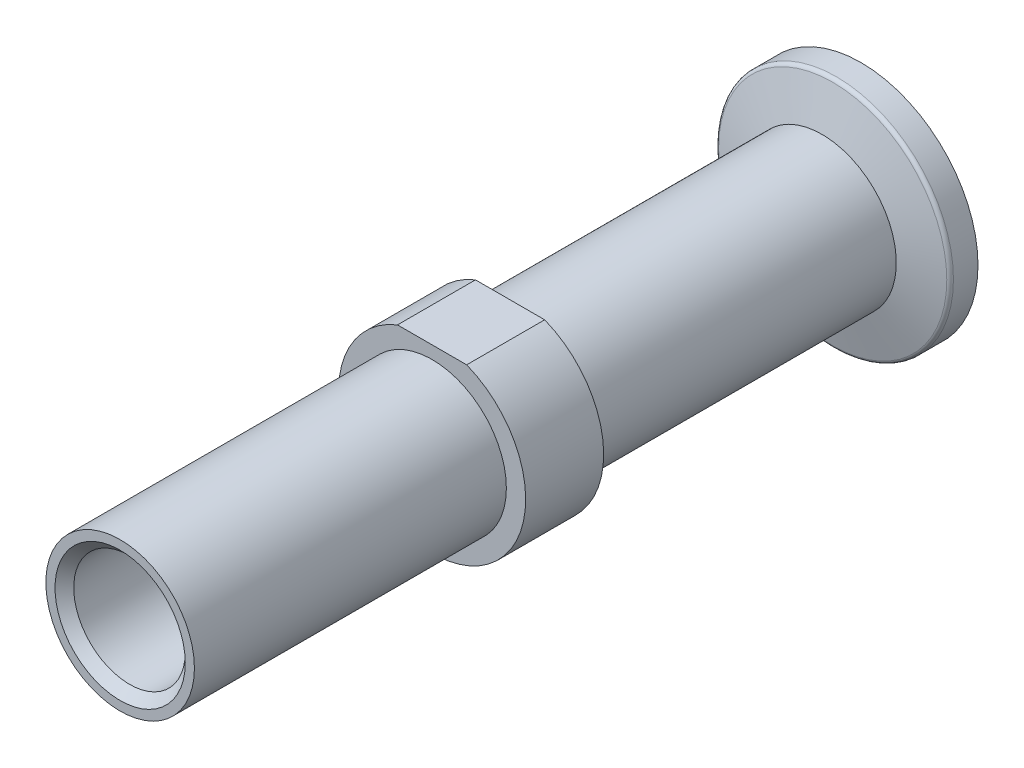
ISO-10303-21;
HEADER;
FILE_DESCRIPTION(('STEP AP214'),'2;1');
FILE_NAME('part.step','',(''),(''),'','','');
FILE_SCHEMA(('AUTOMOTIVE_DESIGN { 1 0 10303 214 1 1 1 1 }'));
ENDSEC;
DATA;
#1=APPLICATION_CONTEXT('core data for automotive mechanical design processes');
#2=APPLICATION_PROTOCOL_DEFINITION('international standard','automotive_design',2000,#1);
#3=PRODUCT_CONTEXT('',#1,'mechanical');
#4=PRODUCT('Part','Part','',(#3));
#5=PRODUCT_RELATED_PRODUCT_CATEGORY('part','',(#4));
#6=PRODUCT_DEFINITION_FORMATION('','',#4);
#7=PRODUCT_DEFINITION_CONTEXT('part definition',#1,'design');
#8=PRODUCT_DEFINITION('design','',#6,#7);
#9=PRODUCT_DEFINITION_SHAPE('','',#8);
#10=(LENGTH_UNIT() NAMED_UNIT(*) SI_UNIT(.MILLI.,.METRE.));
#11=(NAMED_UNIT(*) PLANE_ANGLE_UNIT() SI_UNIT($,.RADIAN.));
#12=(NAMED_UNIT(*) SI_UNIT($,.STERADIAN.) SOLID_ANGLE_UNIT());
#13=UNCERTAINTY_MEASURE_WITH_UNIT(LENGTH_MEASURE(1.E-05),#10,'distance_accuracy_value','');
#14=(GEOMETRIC_REPRESENTATION_CONTEXT(3) GLOBAL_UNCERTAINTY_ASSIGNED_CONTEXT((#13)) GLOBAL_UNIT_ASSIGNED_CONTEXT((#10,
#11,#12)) REPRESENTATION_CONTEXT('',''));
#15=CARTESIAN_POINT('',(0.,0.,0.));
#16=DIRECTION('',(0.,0.,1.));
#17=DIRECTION('',(1.,0.,0.));
#18=AXIS2_PLACEMENT_3D('',#15,#16,#17);
#19=CARTESIAN_POINT('',(0.,0.,90.));
#20=DIRECTION('',(0.,0.,-1.));
#21=DIRECTION('',(-1.,0.,0.));
#22=AXIS2_PLACEMENT_3D('',#19,#20,#21);
#23=CYLINDRICAL_SURFACE('',#22,12.);
#24=CARTESIAN_POINT('',(0.,0.,40.));
#25=DIRECTION('',(0.,0.,-1.));
#26=DIRECTION('',(-1.,0.,0.));
#27=AXIS2_PLACEMENT_3D('',#24,#25,#26);
#28=CIRCLE('',#27,12.);
#29=CARTESIAN_POINT('',(4.43593282185383,11.15,40.));
#30=VERTEX_POINT('',#29);
#31=CARTESIAN_POINT('',(-4.43593282185383,11.15,40.));
#32=VERTEX_POINT('',#31);
#33=EDGE_CURVE('E96',#30,#32,#28,.T.);
#34=ORIENTED_EDGE('',*,*,#33,.F.);
#35=DIRECTION('',(0.,0.,-1.));
#36=VECTOR('',#35,1.);
#37=CARTESIAN_POINT('',(4.43593282185383,11.15,90.));
#38=LINE('',#37,#36);
#39=CARTESIAN_POINT('',(4.43593282185383,11.15,50.));
#40=VERTEX_POINT('',#39);
#41=EDGE_CURVE('E61',#40,#30,#38,.T.);
#42=ORIENTED_EDGE('',*,*,#41,.F.);
#43=CARTESIAN_POINT('',(0.,0.,50.));
#44=DIRECTION('',(0.,0.,1.));
#45=DIRECTION('',(1.,0.,0.));
#46=AXIS2_PLACEMENT_3D('',#43,#44,#45);
#47=CIRCLE('',#46,12.);
#48=CARTESIAN_POINT('',(-4.43593282185383,11.15,50.));
#49=VERTEX_POINT('',#48);
#50=EDGE_CURVE('E83',#49,#40,#47,.T.);
#51=ORIENTED_EDGE('',*,*,#50,.F.);
#52=DIRECTION('',(0.,0.,-1.));
#53=VECTOR('',#52,1.);
#54=CARTESIAN_POINT('',(-4.43593282185383,11.15,90.));
#55=LINE('',#54,#53);
#56=EDGE_CURVE('E71',#49,#32,#55,.T.);
#57=ORIENTED_EDGE('',*,*,#56,.T.);
#58=EDGE_LOOP('',(#34,#42,#51,#57));
#59=FACE_BOUND('',#58,.T.);
#60=ADVANCED_FACE('F47',(#59),#23,.T.);
#61=CARTESIAN_POINT('',(0.,0.,50.));
#62=DIRECTION('',(0.,0.,1.));
#63=DIRECTION('',(1.,0.,0.));
#64=AXIS2_PLACEMENT_3D('',#61,#62,#63);
#65=PLANE('',#64);
#66=DIRECTION('',(1.,0.,0.));
#67=VECTOR('',#66,1.);
#68=CARTESIAN_POINT('',(0.,11.15,50.));
#69=LINE('',#68,#67);
#70=EDGE_CURVE('E66',#49,#40,#69,.T.);
#71=ORIENTED_EDGE('',*,*,#70,.F.);
#72=ORIENTED_EDGE('',*,*,#50,.T.);
#73=EDGE_LOOP('',(#71,#72));
#74=FACE_BOUND('',#73,.T.);
#75=CARTESIAN_POINT('',(0.,0.,50.));
#76=DIRECTION('',(0.,0.,1.));
#77=DIRECTION('',(1.,0.,0.));
#78=AXIS2_PLACEMENT_3D('',#75,#76,#77);
#79=CIRCLE('',#78,9.525);
#80=CARTESIAN_POINT('',(9.525,0.,50.));
#81=VERTEX_POINT('',#80);
#82=EDGE_CURVE('E87',#81,#81,#79,.T.);
#83=ORIENTED_EDGE('',*,*,#82,.F.);
#84=EDGE_LOOP('',(#83));
#85=FACE_BOUND('',#84,.T.);
#86=ADVANCED_FACE('F81',(#74,#85),#65,.T.);
#87=CARTESIAN_POINT('',(0.,0.,50.));
#88=DIRECTION('',(0.,0.,1.));
#89=DIRECTION('',(1.,0.,0.));
#90=AXIS2_PLACEMENT_3D('',#87,#88,#89);
#91=CYLINDRICAL_SURFACE('',#90,9.525);
#92=ORIENTED_EDGE('',*,*,#82,.T.);
#93=EDGE_LOOP('',(#92));
#94=FACE_BOUND('',#93,.T.);
#95=CARTESIAN_POINT('',(0.,0.,90.));
#96=DIRECTION('',(0.,0.,1.));
#97=DIRECTION('',(1.,0.,0.));
#98=AXIS2_PLACEMENT_3D('',#95,#96,#97);
#99=CIRCLE('',#98,9.525);
#100=CARTESIAN_POINT('',(9.525,0.,90.));
#101=VERTEX_POINT('',#100);
#102=EDGE_CURVE('E92',#101,#101,#99,.T.);
#103=ORIENTED_EDGE('',*,*,#102,.F.);
#104=EDGE_LOOP('',(#103));
#105=FACE_BOUND('',#104,.T.);
#106=ADVANCED_FACE('F154',(#94,#105),#91,.T.);
#107=CARTESIAN_POINT('',(0.,0.,90.));
#108=DIRECTION('',(0.,0.,1.));
#109=DIRECTION('',(1.,0.,0.));
#110=AXIS2_PLACEMENT_3D('',#107,#108,#109);
#111=PLANE('',#110);
#112=CARTESIAN_POINT('',(0.,0.,90.));
#113=DIRECTION('',(0.,0.,1.));
#114=DIRECTION('',(1.,0.,0.));
#115=AXIS2_PLACEMENT_3D('',#112,#113,#114);
#116=CIRCLE('',#115,8.35000000000008);
#117=CARTESIAN_POINT('',(8.35000000000008,0.,90.));
#118=VERTEX_POINT('',#117);
#119=EDGE_CURVE('E55',#118,#118,#116,.F.);
#120=ORIENTED_EDGE('',*,*,#119,.T.);
#121=EDGE_LOOP('',(#120));
#122=FACE_BOUND('',#121,.T.);
#123=ORIENTED_EDGE('',*,*,#102,.T.);
#124=EDGE_LOOP('',(#123));
#125=FACE_BOUND('',#124,.T.);
#126=ADVANCED_FACE('F101',(#122,#125),#111,.T.);
#127=CARTESIAN_POINT('',(0.,0.,40.));
#128=DIRECTION('',(0.,0.,-1.));
#129=DIRECTION('',(-1.,0.,0.));
#130=AXIS2_PLACEMENT_3D('',#127,#128,#129);
#131=PLANE('',#130);
#132=DIRECTION('',(-1.,0.,0.));
#133=VECTOR('',#132,1.);
#134=CARTESIAN_POINT('',(0.,11.15,40.));
#135=LINE('',#134,#133);
#136=EDGE_CURVE('E14',#30,#32,#135,.T.);
#137=ORIENTED_EDGE('',*,*,#136,.F.);
#138=ORIENTED_EDGE('',*,*,#33,.T.);
#139=EDGE_LOOP('',(#137,#138));
#140=FACE_BOUND('',#139,.T.);
#141=CARTESIAN_POINT('',(0.,0.,40.));
#142=DIRECTION('',(0.,0.,-1.));
#143=DIRECTION('',(-1.,0.,0.));
#144=AXIS2_PLACEMENT_3D('',#141,#142,#143);
#145=CIRCLE('',#144,9.525);
#146=CARTESIAN_POINT('',(-9.525,0.,40.));
#147=VERTEX_POINT('',#146);
#148=EDGE_CURVE('E97',#147,#147,#145,.T.);
#149=ORIENTED_EDGE('',*,*,#148,.F.);
#150=EDGE_LOOP('',(#149));
#151=FACE_BOUND('',#150,.T.);
#152=ADVANCED_FACE('F142',(#140,#151),#131,.T.);
#153=CARTESIAN_POINT('',(0.,0.,40.));
#154=DIRECTION('',(0.,0.,-1.));
#155=DIRECTION('',(-1.,0.,0.));
#156=AXIS2_PLACEMENT_3D('',#153,#154,#155);
#157=CYLINDRICAL_SURFACE('',#156,9.525);
#158=ORIENTED_EDGE('',*,*,#148,.T.);
#159=EDGE_LOOP('',(#158));
#160=FACE_BOUND('',#159,.T.);
#161=CARTESIAN_POINT('',(0.,0.,0.));
#162=DIRECTION('',(0.,0.,-1.));
#163=DIRECTION('',(-1.,0.,0.));
#164=AXIS2_PLACEMENT_3D('',#161,#162,#163);
#165=CIRCLE('',#164,9.525);
#166=CARTESIAN_POINT('',(-9.525,0.,0.));
#167=VERTEX_POINT('',#166);
#168=EDGE_CURVE('E84',#167,#167,#165,.T.);
#169=ORIENTED_EDGE('',*,*,#168,.F.);
#170=EDGE_LOOP('',(#169));
#171=FACE_BOUND('',#170,.T.);
#172=ADVANCED_FACE('F111',(#160,#171),#157,.T.);
#173=CARTESIAN_POINT('',(0.,0.,0.));
#174=DIRECTION('',(0.,0.,1.));
#175=DIRECTION('',(1.,0.,0.));
#176=AXIS2_PLACEMENT_3D('',#173,#174,#175);
#177=CYLINDRICAL_SURFACE('',#176,7.15);
#178=CARTESIAN_POINT('',(0.,0.,88.7999999999999));
#179=DIRECTION('',(0.,0.,1.));
#180=DIRECTION('',(1.,0.,0.));
#181=AXIS2_PLACEMENT_3D('',#178,#179,#180);
#182=CIRCLE('',#181,7.15);
#183=CARTESIAN_POINT('',(7.15,0.,88.7999999999999));
#184=VERTEX_POINT('',#183);
#185=EDGE_CURVE('E86',#184,#184,#182,.T.);
#186=ORIENTED_EDGE('',*,*,#185,.T.);
#187=EDGE_LOOP('',(#186));
#188=FACE_BOUND('',#187,.T.);
#189=CARTESIAN_POINT('',(0.,0.,-2.5));
#190=DIRECTION('',(0.,0.,1.));
#191=DIRECTION('',(1.,0.,0.));
#192=AXIS2_PLACEMENT_3D('',#189,#190,#191);
#193=CIRCLE('',#192,7.15);
#194=CARTESIAN_POINT('',(7.15,0.,-2.5));
#195=VERTEX_POINT('',#194);
#196=EDGE_CURVE('E115',#195,#195,#193,.T.);
#197=ORIENTED_EDGE('',*,*,#196,.F.);
#198=EDGE_LOOP('',(#197));
#199=FACE_BOUND('',#198,.T.);
#200=ADVANCED_FACE('F106',(#188,#199),#177,.F.);
#201=CARTESIAN_POINT('',(0.,0.,88.7999999999999));
#202=DIRECTION('',(0.,0.,1.));
#203=DIRECTION('',(1.,0.,0.));
#204=AXIS2_PLACEMENT_3D('',#201,#202,#203);
#205=CONICAL_SURFACE('',#204,7.15,0.785398163397444);
#206=ORIENTED_EDGE('',*,*,#119,.F.);
#207=EDGE_LOOP('',(#206));
#208=FACE_BOUND('',#207,.T.);
#209=ORIENTED_EDGE('',*,*,#185,.F.);
#210=EDGE_LOOP('',(#209));
#211=FACE_BOUND('',#210,.T.);
#212=ADVANCED_FACE('F49',(#208,#211),#205,.F.);
#213=CARTESIAN_POINT('',(0.,11.15,90.));
#214=DIRECTION('',(0.,-1.,0.));
#215=DIRECTION('',(0.,0.,-1.));
#216=AXIS2_PLACEMENT_3D('',#213,#214,#215);
#217=PLANE('',#216);
#218=ORIENTED_EDGE('',*,*,#70,.T.);
#219=ORIENTED_EDGE('',*,*,#41,.T.);
#220=ORIENTED_EDGE('',*,*,#136,.T.);
#221=ORIENTED_EDGE('',*,*,#56,.F.);
#222=EDGE_LOOP('',(#218,#219,#220,#221));
#223=FACE_BOUND('',#222,.T.);
#224=ADVANCED_FACE('F72',(#223),#217,.F.);
#225=CARTESIAN_POINT('',(0.,0.,0.));
#226=DIRECTION('',(0.,0.,-1.));
#227=DIRECTION('',(-1.,0.,0.));
#228=AXIS2_PLACEMENT_3D('',#225,#226,#227);
#229=CONICAL_SURFACE('',#228,9.525,1.30899693899575);
#230=CARTESIAN_POINT('',(0.,0.,-1.36772240940533));
#231=DIRECTION('',(0.,0.,1.));
#232=DIRECTION('',(1.,0.,0.));
#233=AXIS2_PLACEMENT_3D('',#230,#231,#232);
#234=CIRCLE('',#233,14.6294095225513);
#235=CARTESIAN_POINT('',(14.6294095225513,0.,-1.36772240940533));
#236=VERTEX_POINT('',#235);
#237=EDGE_CURVE('E77',#236,#236,#234,.T.);
#238=ORIENTED_EDGE('',*,*,#237,.T.);
#239=EDGE_LOOP('',(#238));
#240=FACE_BOUND('',#239,.T.);
#241=ORIENTED_EDGE('',*,*,#168,.T.);
#242=EDGE_LOOP('',(#241));
#243=FACE_BOUND('',#242,.T.);
#244=ADVANCED_FACE('F139',(#240,#243),#229,.T.);
#245=CARTESIAN_POINT('',(0.,0.,-1.85068532254986));
#246=DIRECTION('',(0.,0.,1.));
#247=DIRECTION('',(1.,0.,0.));
#248=AXIS2_PLACEMENT_3D('',#245,#246,#247);
#249=TOROIDAL_SURFACE('',#248,14.5,0.5);
#250=CARTESIAN_POINT('',(0.,0.,-1.85068532254986));
#251=DIRECTION('',(0.,0.,1.));
#252=DIRECTION('',(1.,0.,0.));
#253=AXIS2_PLACEMENT_3D('',#250,#251,#252);
#254=CIRCLE('',#253,15.);
#255=CARTESIAN_POINT('',(15.,0.,-1.85068532254986));
#256=VERTEX_POINT('',#255);
#257=EDGE_CURVE('E128',#256,#256,#254,.T.);
#258=ORIENTED_EDGE('',*,*,#257,.T.);
#259=EDGE_LOOP('',(#258));
#260=FACE_BOUND('',#259,.T.);
#261=ORIENTED_EDGE('',*,*,#237,.F.);
#262=EDGE_LOOP('',(#261));
#263=FACE_BOUND('',#262,.T.);
#264=ADVANCED_FACE('F207',(#260,#263),#249,.T.);
#265=CARTESIAN_POINT('',(0.,0.,1.6));
#266=DIRECTION('',(0.,0.,1.));
#267=DIRECTION('',(1.,0.,0.));
#268=AXIS2_PLACEMENT_3D('',#265,#266,#267);
#269=CYLINDRICAL_SURFACE('',#268,15.);
#270=CARTESIAN_POINT('',(0.,0.,-5.));
#271=DIRECTION('',(0.,0.,1.));
#272=DIRECTION('',(1.,0.,0.));
#273=AXIS2_PLACEMENT_3D('',#270,#271,#272);
#274=CIRCLE('',#273,15.);
#275=CARTESIAN_POINT('',(15.,0.,-5.));
#276=VERTEX_POINT('',#275);
#277=EDGE_CURVE('E125',#276,#276,#274,.T.);
#278=ORIENTED_EDGE('',*,*,#277,.T.);
#279=EDGE_LOOP('',(#278));
#280=FACE_BOUND('',#279,.T.);
#281=ORIENTED_EDGE('',*,*,#257,.F.);
#282=EDGE_LOOP('',(#281));
#283=FACE_BOUND('',#282,.T.);
#284=ADVANCED_FACE('F217',(#280,#283),#269,.T.);
#285=CARTESIAN_POINT('',(15.,0.,-5.));
#286=DIRECTION('',(0.,0.,-1.));
#287=DIRECTION('',(-1.,0.,0.));
#288=AXIS2_PLACEMENT_3D('',#285,#286,#287);
#289=PLANE('',#288);
#290=CARTESIAN_POINT('',(0.,0.,-5.));
#291=DIRECTION('',(0.,0.,1.));
#292=DIRECTION('',(1.,0.,0.));
#293=AXIS2_PLACEMENT_3D('',#290,#291,#292);
#294=CIRCLE('',#293,9.);
#295=CARTESIAN_POINT('',(9.,0.,-5.));
#296=VERTEX_POINT('',#295);
#297=EDGE_CURVE('E120',#296,#296,#294,.T.);
#298=ORIENTED_EDGE('',*,*,#297,.T.);
#299=EDGE_LOOP('',(#298));
#300=FACE_BOUND('',#299,.T.);
#301=ORIENTED_EDGE('',*,*,#277,.F.);
#302=EDGE_LOOP('',(#301));
#303=FACE_BOUND('',#302,.T.);
#304=ADVANCED_FACE('F227',(#300,#303),#289,.T.);
#305=CARTESIAN_POINT('',(0.,0.,1.6));
#306=DIRECTION('',(0.,0.,1.));
#307=DIRECTION('',(1.,0.,0.));
#308=AXIS2_PLACEMENT_3D('',#305,#306,#307);
#309=CYLINDRICAL_SURFACE('',#308,9.);
#310=CARTESIAN_POINT('',(0.,0.,-2.5));
#311=DIRECTION('',(0.,0.,1.));
#312=DIRECTION('',(1.,0.,0.));
#313=AXIS2_PLACEMENT_3D('',#310,#311,#312);
#314=CIRCLE('',#313,9.);
#315=CARTESIAN_POINT('',(9.,0.,-2.5));
#316=VERTEX_POINT('',#315);
#317=EDGE_CURVE('E117',#316,#316,#314,.T.);
#318=ORIENTED_EDGE('',*,*,#317,.T.);
#319=EDGE_LOOP('',(#318));
#320=FACE_BOUND('',#319,.T.);
#321=ORIENTED_EDGE('',*,*,#297,.F.);
#322=EDGE_LOOP('',(#321));
#323=FACE_BOUND('',#322,.T.);
#324=ADVANCED_FACE('F237',(#320,#323),#309,.F.);
#325=CARTESIAN_POINT('',(9.,0.,-2.5));
#326=DIRECTION('',(0.,0.,-1.));
#327=DIRECTION('',(-1.,0.,0.));
#328=AXIS2_PLACEMENT_3D('',#325,#326,#327);
#329=PLANE('',#328);
#330=ORIENTED_EDGE('',*,*,#196,.T.);
#331=EDGE_LOOP('',(#330));
#332=FACE_BOUND('',#331,.T.);
#333=ORIENTED_EDGE('',*,*,#317,.F.);
#334=EDGE_LOOP('',(#333));
#335=FACE_BOUND('',#334,.T.);
#336=ADVANCED_FACE('F247',(#332,#335),#329,.T.);
#337=CLOSED_SHELL('',(#60,#86,#106,#126,#152,#172,#200,#212,#224,#244,#264,#284,#304,#324,#336));
#338=MANIFOLD_SOLID_BREP('B2',#337);
#339=ADVANCED_BREP_SHAPE_REPRESENTATION('',(#18,#338),#14);
#340=SHAPE_DEFINITION_REPRESENTATION(#9,#339);
ENDSEC;
END-ISO-10303-21;
